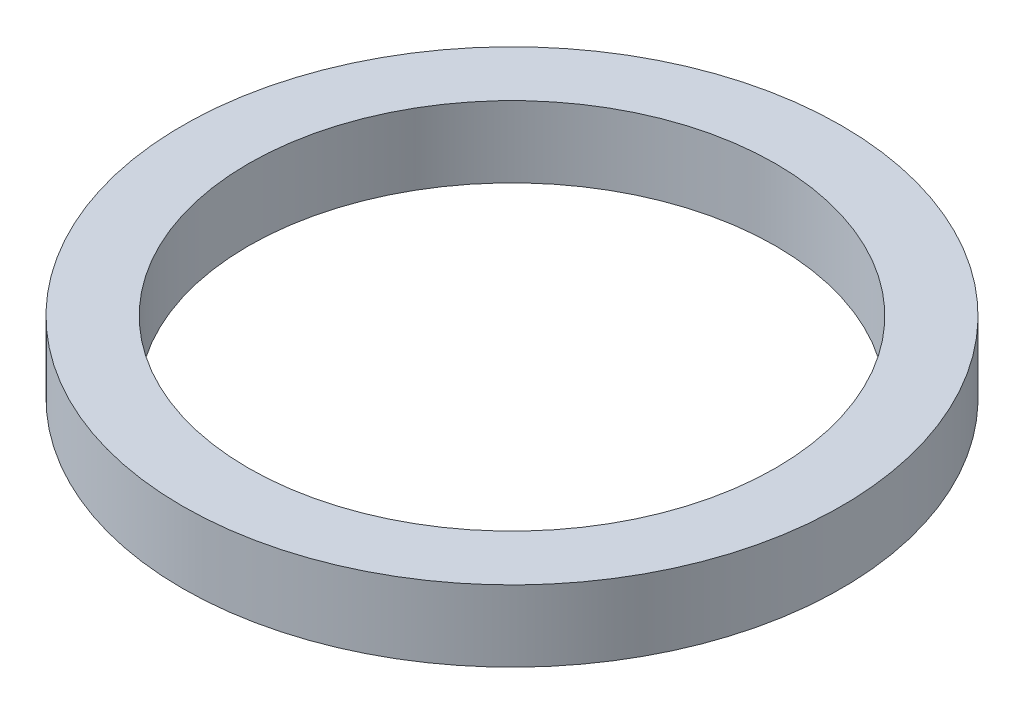
ISO-10303-21;
HEADER;
FILE_DESCRIPTION(('STEP AP214'),'2;1');
FILE_NAME('part.step','',(''),(''),'','','');
FILE_SCHEMA(('AUTOMOTIVE_DESIGN { 1 0 10303 214 1 1 1 1 }'));
ENDSEC;
DATA;
#1=APPLICATION_CONTEXT('core data for automotive mechanical design processes');
#2=APPLICATION_PROTOCOL_DEFINITION('international standard','automotive_design',2000,#1);
#3=PRODUCT_CONTEXT('',#1,'mechanical');
#4=PRODUCT('Part','Part','',(#3));
#5=PRODUCT_RELATED_PRODUCT_CATEGORY('part','',(#4));
#6=PRODUCT_DEFINITION_FORMATION('','',#4);
#7=PRODUCT_DEFINITION_CONTEXT('part definition',#1,'design');
#8=PRODUCT_DEFINITION('design','',#6,#7);
#9=PRODUCT_DEFINITION_SHAPE('','',#8);
#10=(LENGTH_UNIT() NAMED_UNIT(*) SI_UNIT(.MILLI.,.METRE.));
#11=(NAMED_UNIT(*) PLANE_ANGLE_UNIT() SI_UNIT($,.RADIAN.));
#12=(NAMED_UNIT(*) SI_UNIT($,.STERADIAN.) SOLID_ANGLE_UNIT());
#13=UNCERTAINTY_MEASURE_WITH_UNIT(LENGTH_MEASURE(1.E-05),#10,'distance_accuracy_value','');
#14=(GEOMETRIC_REPRESENTATION_CONTEXT(3) GLOBAL_UNCERTAINTY_ASSIGNED_CONTEXT((#13)) GLOBAL_UNIT_ASSIGNED_CONTEXT((#10,
#11,#12)) REPRESENTATION_CONTEXT('',''));
#15=CARTESIAN_POINT('',(0.,0.,0.));
#16=DIRECTION('',(0.,0.,1.));
#17=DIRECTION('',(1.,0.,0.));
#18=AXIS2_PLACEMENT_3D('',#15,#16,#17);
#19=CARTESIAN_POINT('',(0.,2.,0.));
#20=DIRECTION('',(0.,1.,0.));
#21=DIRECTION('',(0.,0.,1.));
#22=AXIS2_PLACEMENT_3D('',#19,#20,#21);
#23=PLANE('',#22);
#24=CARTESIAN_POINT('',(0.,2.,0.));
#25=DIRECTION('',(0.,1.,0.));
#26=DIRECTION('',(0.,0.,1.));
#27=AXIS2_PLACEMENT_3D('',#24,#25,#26);
#28=CIRCLE('',#27,9.25);
#29=CARTESIAN_POINT('',(0.,2.,9.25));
#30=VERTEX_POINT('',#29);
#31=EDGE_CURVE('E10',#30,#30,#28,.T.);
#32=ORIENTED_EDGE('',*,*,#31,.T.);
#33=EDGE_LOOP('',(#32));
#34=FACE_BOUND('',#33,.T.);
#35=CARTESIAN_POINT('',(0.,2.,0.));
#36=DIRECTION('',(0.,1.,0.));
#37=DIRECTION('',(0.,0.,1.));
#38=AXIS2_PLACEMENT_3D('',#35,#36,#37);
#39=CIRCLE('',#38,7.4);
#40=CARTESIAN_POINT('',(0.,2.,7.4));
#41=VERTEX_POINT('',#40);
#42=EDGE_CURVE('E46',#41,#41,#39,.T.);
#43=ORIENTED_EDGE('',*,*,#42,.F.);
#44=EDGE_LOOP('',(#43));
#45=FACE_BOUND('',#44,.T.);
#46=ADVANCED_FACE('F33',(#34,#45),#23,.T.);
#47=CARTESIAN_POINT('',(0.,0.,0.));
#48=DIRECTION('',(0.,1.,0.));
#49=DIRECTION('',(0.,0.,1.));
#50=AXIS2_PLACEMENT_3D('',#47,#48,#49);
#51=PLANE('',#50);
#52=CARTESIAN_POINT('',(0.,0.,0.));
#53=DIRECTION('',(0.,1.,0.));
#54=DIRECTION('',(0.,0.,1.));
#55=AXIS2_PLACEMENT_3D('',#52,#53,#54);
#56=CIRCLE('',#55,9.25);
#57=CARTESIAN_POINT('',(0.,0.,9.25));
#58=VERTEX_POINT('',#57);
#59=EDGE_CURVE('E37',#58,#58,#56,.T.);
#60=ORIENTED_EDGE('',*,*,#59,.F.);
#61=EDGE_LOOP('',(#60));
#62=FACE_BOUND('',#61,.T.);
#63=CARTESIAN_POINT('',(0.,0.,0.));
#64=DIRECTION('',(0.,1.,0.));
#65=DIRECTION('',(0.,0.,1.));
#66=AXIS2_PLACEMENT_3D('',#63,#64,#65);
#67=CIRCLE('',#66,7.4);
#68=CARTESIAN_POINT('',(0.,0.,7.4));
#69=VERTEX_POINT('',#68);
#70=EDGE_CURVE('E48',#69,#69,#67,.T.);
#71=ORIENTED_EDGE('',*,*,#70,.T.);
#72=EDGE_LOOP('',(#71));
#73=FACE_BOUND('',#72,.T.);
#74=ADVANCED_FACE('F60',(#62,#73),#51,.F.);
#75=CARTESIAN_POINT('',(0.,2.,0.));
#76=DIRECTION('',(0.,-1.,0.));
#77=DIRECTION('',(0.,0.,-1.));
#78=AXIS2_PLACEMENT_3D('',#75,#76,#77);
#79=CYLINDRICAL_SURFACE('',#78,9.25);
#80=ORIENTED_EDGE('',*,*,#31,.F.);
#81=EDGE_LOOP('',(#80));
#82=FACE_BOUND('',#81,.T.);
#83=ORIENTED_EDGE('',*,*,#59,.T.);
#84=EDGE_LOOP('',(#83));
#85=FACE_BOUND('',#84,.T.);
#86=ADVANCED_FACE('F35',(#82,#85),#79,.T.);
#87=CARTESIAN_POINT('',(0.,2.,0.));
#88=DIRECTION('',(0.,-1.,0.));
#89=DIRECTION('',(0.,0.,-1.));
#90=AXIS2_PLACEMENT_3D('',#87,#88,#89);
#91=CYLINDRICAL_SURFACE('',#90,7.4);
#92=ORIENTED_EDGE('',*,*,#42,.T.);
#93=EDGE_LOOP('',(#92));
#94=FACE_BOUND('',#93,.T.);
#95=ORIENTED_EDGE('',*,*,#70,.F.);
#96=EDGE_LOOP('',(#95));
#97=FACE_BOUND('',#96,.T.);
#98=ADVANCED_FACE('F56',(#94,#97),#91,.F.);
#99=CLOSED_SHELL('',(#46,#74,#86,#98));
#100=MANIFOLD_SOLID_BREP('B2',#99);
#101=ADVANCED_BREP_SHAPE_REPRESENTATION('',(#18,#100),#14);
#102=SHAPE_DEFINITION_REPRESENTATION(#9,#101);
ENDSEC;
END-ISO-10303-21;
